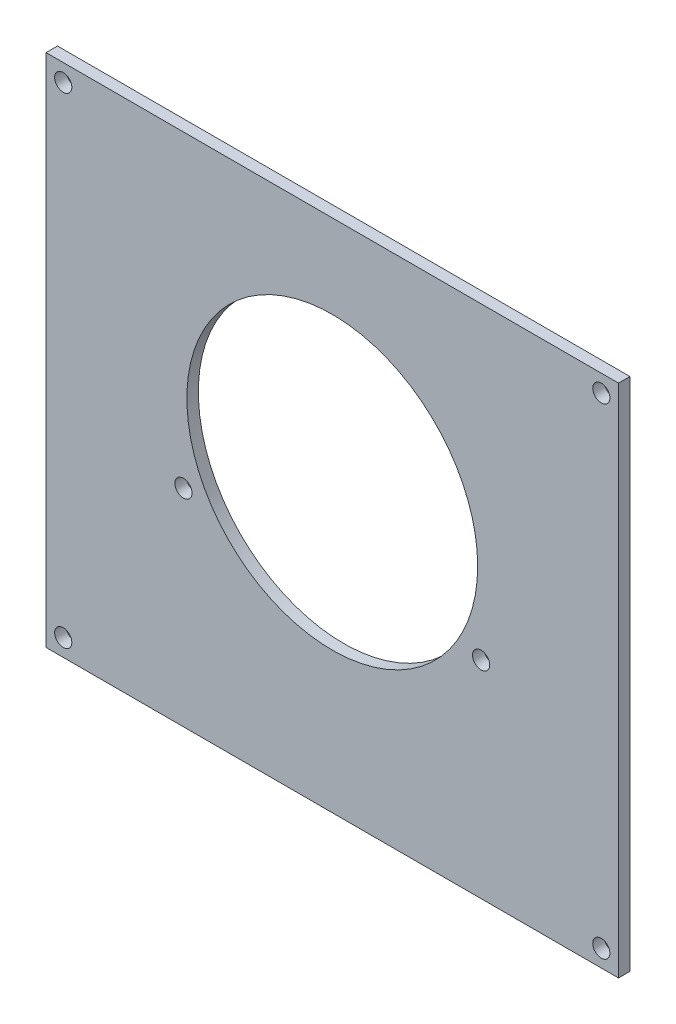
ISO-10303-21;
HEADER;
FILE_DESCRIPTION(('STEP AP214'),'2;1');
FILE_NAME('part.step','',(''),(''),'','','');
FILE_SCHEMA(('AUTOMOTIVE_DESIGN { 1 0 10303 214 1 1 1 1 }'));
ENDSEC;
DATA;
#1=APPLICATION_CONTEXT('core data for automotive mechanical design processes');
#2=APPLICATION_PROTOCOL_DEFINITION('international standard','automotive_design',2000,#1);
#3=PRODUCT_CONTEXT('',#1,'mechanical');
#4=PRODUCT('Part','Part','',(#3));
#5=PRODUCT_RELATED_PRODUCT_CATEGORY('part','',(#4));
#6=PRODUCT_DEFINITION_FORMATION('','',#4);
#7=PRODUCT_DEFINITION_CONTEXT('part definition',#1,'design');
#8=PRODUCT_DEFINITION('design','',#6,#7);
#9=PRODUCT_DEFINITION_SHAPE('','',#8);
#10=(LENGTH_UNIT() NAMED_UNIT(*) SI_UNIT(.MILLI.,.METRE.));
#11=(NAMED_UNIT(*) PLANE_ANGLE_UNIT() SI_UNIT($,.RADIAN.));
#12=(NAMED_UNIT(*) SI_UNIT($,.STERADIAN.) SOLID_ANGLE_UNIT());
#13=UNCERTAINTY_MEASURE_WITH_UNIT(LENGTH_MEASURE(1.E-05),#10,'distance_accuracy_value','');
#14=(GEOMETRIC_REPRESENTATION_CONTEXT(3) GLOBAL_UNCERTAINTY_ASSIGNED_CONTEXT((#13)) GLOBAL_UNIT_ASSIGNED_CONTEXT((#10,
#11,#12)) REPRESENTATION_CONTEXT('',''));
#15=CARTESIAN_POINT('',(0.,0.,0.));
#16=DIRECTION('',(0.,0.,1.));
#17=DIRECTION('',(1.,0.,0.));
#18=AXIS2_PLACEMENT_3D('',#15,#16,#17);
#19=CARTESIAN_POINT('',(0.,0.,0.));
#20=DIRECTION('',(0.,0.,1.));
#21=DIRECTION('',(1.,0.,0.));
#22=AXIS2_PLACEMENT_3D('',#19,#20,#21);
#23=PLANE('',#22);
#24=CARTESIAN_POINT('',(-73.2247091506369,-0.68557907607758,0.));
#25=DIRECTION('',(0.,0.,-1.));
#26=DIRECTION('',(-1.,0.,0.));
#27=AXIS2_PLACEMENT_3D('',#24,#25,#26);
#28=CIRCLE('',#27,1.51130000000001);
#29=CARTESIAN_POINT('',(-74.7360091506369,-0.68557907607758,0.));
#30=VERTEX_POINT('',#29);
#31=EDGE_CURVE('E349',#30,#30,#28,.T.);
#32=ORIENTED_EDGE('',*,*,#31,.F.);
#33=EDGE_LOOP('',(#32));
#34=FACE_BOUND('',#33,.T.);
#35=CARTESIAN_POINT('',(20.7752908493632,-0.685579076077578,0.));
#36=DIRECTION('',(0.,0.,-1.));
#37=DIRECTION('',(-1.,0.,0.));
#38=AXIS2_PLACEMENT_3D('',#35,#36,#37);
#39=CIRCLE('',#38,1.5113);
#40=CARTESIAN_POINT('',(19.2639908493632,-0.685579076077578,0.));
#41=VERTEX_POINT('',#40);
#42=EDGE_CURVE('E355',#41,#41,#39,.T.);
#43=ORIENTED_EDGE('',*,*,#42,.F.);
#44=EDGE_LOOP('',(#43));
#45=FACE_BOUND('',#44,.T.);
#46=CARTESIAN_POINT('',(-52.2247091506368,32.4144209239224,0.));
#47=DIRECTION('',(0.,0.,1.));
#48=DIRECTION('',(1.,0.,0.));
#49=AXIS2_PLACEMENT_3D('',#46,#47,#48);
#50=CIRCLE('',#49,1.5);
#51=CARTESIAN_POINT('',(-50.7247091506368,32.4144209239224,0.));
#52=VERTEX_POINT('',#51);
#53=EDGE_CURVE('E41',#52,#52,#50,.T.);
#54=ORIENTED_EDGE('',*,*,#53,.T.);
#55=EDGE_LOOP('',(#54));
#56=FACE_BOUND('',#55,.T.);
#57=CARTESIAN_POINT('',(-0.224709150636847,32.4144209239224,0.));
#58=DIRECTION('',(0.,0.,1.));
#59=DIRECTION('',(1.,0.,0.));
#60=AXIS2_PLACEMENT_3D('',#57,#58,#59);
#61=CIRCLE('',#60,1.5);
#62=CARTESIAN_POINT('',(1.27529084936315,32.4144209239224,0.));
#63=VERTEX_POINT('',#62);
#64=EDGE_CURVE('E115',#63,#63,#61,.T.);
#65=ORIENTED_EDGE('',*,*,#64,.T.);
#66=EDGE_LOOP('',(#65));
#67=FACE_BOUND('',#66,.T.);
#68=CARTESIAN_POINT('',(-26.2247091506368,46.3144209239224,0.));
#69=DIRECTION('',(0.,0.,1.));
#70=DIRECTION('',(1.,0.,0.));
#71=AXIS2_PLACEMENT_3D('',#68,#69,#70);
#72=CIRCLE('',#71,25.4);
#73=CARTESIAN_POINT('',(-0.82470915063684,46.3144209239224,0.));
#74=VERTEX_POINT('',#73);
#75=EDGE_CURVE('E107',#74,#74,#72,.T.);
#76=ORIENTED_EDGE('',*,*,#75,.T.);
#77=EDGE_LOOP('',(#76));
#78=FACE_BOUND('',#77,.T.);
#79=DIRECTION('',(0.,-1.,0.));
#80=VECTOR('',#79,1.);
#81=CARTESIAN_POINT('',(-76.2247091506369,86.3144209239224,0.));
#82=LINE('',#81,#80);
#83=CARTESIAN_POINT('',(-76.2247091506369,86.3144209239224,0.));
#84=VERTEX_POINT('',#83);
#85=CARTESIAN_POINT('',(-76.2247091506368,-3.68557907607758,0.));
#86=VERTEX_POINT('',#85);
#87=EDGE_CURVE('E104',#84,#86,#82,.T.);
#88=ORIENTED_EDGE('',*,*,#87,.F.);
#89=DIRECTION('',(-1.,0.,0.));
#90=VECTOR('',#89,1.);
#91=CARTESIAN_POINT('',(-76.2247091506369,86.3144209239224,0.));
#92=LINE('',#91,#90);
#93=CARTESIAN_POINT('',(23.7752908493632,86.3144209239224,0.));
#94=VERTEX_POINT('',#93);
#95=EDGE_CURVE('E79',#94,#84,#92,.T.);
#96=ORIENTED_EDGE('',*,*,#95,.F.);
#97=DIRECTION('',(0.,1.,0.));
#98=VECTOR('',#97,1.);
#99=CARTESIAN_POINT('',(23.7752908493632,86.3144209239224,0.));
#100=LINE('',#99,#98);
#101=CARTESIAN_POINT('',(23.7752908493632,-3.68557907607758,0.));
#102=VERTEX_POINT('',#101);
#103=EDGE_CURVE('E73',#102,#94,#100,.T.);
#104=ORIENTED_EDGE('',*,*,#103,.F.);
#105=DIRECTION('',(1.,0.,0.));
#106=VECTOR('',#105,1.);
#107=CARTESIAN_POINT('',(-76.2247091506368,-3.68557907607758,0.));
#108=LINE('',#107,#106);
#109=EDGE_CURVE('E95',#86,#102,#108,.T.);
#110=ORIENTED_EDGE('',*,*,#109,.F.);
#111=EDGE_LOOP('',(#88,#96,#104,#110));
#112=FACE_BOUND('',#111,.T.);
#113=CARTESIAN_POINT('',(-73.2247091506369,83.3144209239224,0.));
#114=DIRECTION('',(0.,0.,-1.));
#115=DIRECTION('',(-1.,0.,0.));
#116=AXIS2_PLACEMENT_3D('',#113,#114,#115);
#117=CIRCLE('',#116,1.51130000000001);
#118=CARTESIAN_POINT('',(-74.7360091506369,83.3144209239224,0.));
#119=VERTEX_POINT('',#118);
#120=EDGE_CURVE('E340',#119,#119,#117,.T.);
#121=ORIENTED_EDGE('',*,*,#120,.F.);
#122=EDGE_LOOP('',(#121));
#123=FACE_BOUND('',#122,.T.);
#124=CARTESIAN_POINT('',(20.7752908493632,83.3144209239224,0.));
#125=DIRECTION('',(0.,0.,-1.));
#126=DIRECTION('',(-1.,0.,0.));
#127=AXIS2_PLACEMENT_3D('',#124,#125,#126);
#128=CIRCLE('',#127,1.5113);
#129=CARTESIAN_POINT('',(19.2639908493632,83.3144209239224,0.));
#130=VERTEX_POINT('',#129);
#131=EDGE_CURVE('E336',#130,#130,#128,.T.);
#132=ORIENTED_EDGE('',*,*,#131,.F.);
#133=EDGE_LOOP('',(#132));
#134=FACE_BOUND('',#133,.T.);
#135=ADVANCED_FACE('F37',(#34,#45,#56,#67,#78,#112,#123,#134),#23,.F.);
#136=CARTESIAN_POINT('',(-76.2247091506369,86.3144209239224,2.));
#137=DIRECTION('',(1.,0.,0.));
#138=DIRECTION('',(0.,1.,0.));
#139=AXIS2_PLACEMENT_3D('',#136,#137,#138);
#140=PLANE('',#139);
#141=ORIENTED_EDGE('',*,*,#87,.T.);
#142=DIRECTION('',(0.,0.,-1.));
#143=VECTOR('',#142,1.);
#144=CARTESIAN_POINT('',(-76.2247091506368,-3.68557907607758,2.));
#145=LINE('',#144,#143);
#146=CARTESIAN_POINT('',(-76.2247091506368,-3.68557907607758,2.));
#147=VERTEX_POINT('',#146);
#148=EDGE_CURVE('E11',#147,#86,#145,.T.);
#149=ORIENTED_EDGE('',*,*,#148,.F.);
#150=DIRECTION('',(0.,-1.,0.));
#151=VECTOR('',#150,1.);
#152=CARTESIAN_POINT('',(-76.2247091506369,86.3144209239224,2.));
#153=LINE('',#152,#151);
#154=CARTESIAN_POINT('',(-76.2247091506369,86.3144209239224,2.));
#155=VERTEX_POINT('',#154);
#156=EDGE_CURVE('E91',#155,#147,#153,.T.);
#157=ORIENTED_EDGE('',*,*,#156,.F.);
#158=DIRECTION('',(0.,0.,-1.));
#159=VECTOR('',#158,1.);
#160=CARTESIAN_POINT('',(-76.2247091506369,86.3144209239224,2.));
#161=LINE('',#160,#159);
#162=EDGE_CURVE('E100',#155,#84,#161,.T.);
#163=ORIENTED_EDGE('',*,*,#162,.T.);
#164=EDGE_LOOP('',(#141,#149,#157,#163));
#165=FACE_BOUND('',#164,.T.);
#166=ADVANCED_FACE('F39',(#165),#140,.F.);
#167=CARTESIAN_POINT('',(-76.2247091506368,-3.68557907607758,2.));
#168=DIRECTION('',(0.,1.,0.));
#169=DIRECTION('',(0.,0.,1.));
#170=AXIS2_PLACEMENT_3D('',#167,#168,#169);
#171=PLANE('',#170);
#172=ORIENTED_EDGE('',*,*,#109,.T.);
#173=DIRECTION('',(0.,0.,-1.));
#174=VECTOR('',#173,1.);
#175=CARTESIAN_POINT('',(23.7752908493632,-3.68557907607758,2.));
#176=LINE('',#175,#174);
#177=CARTESIAN_POINT('',(23.7752908493632,-3.68557907607758,2.));
#178=VERTEX_POINT('',#177);
#179=EDGE_CURVE('E47',#178,#102,#176,.T.);
#180=ORIENTED_EDGE('',*,*,#179,.F.);
#181=DIRECTION('',(1.,0.,0.));
#182=VECTOR('',#181,1.);
#183=CARTESIAN_POINT('',(-76.2247091506368,-3.68557907607758,2.));
#184=LINE('',#183,#182);
#185=EDGE_CURVE('E86',#147,#178,#184,.T.);
#186=ORIENTED_EDGE('',*,*,#185,.F.);
#187=ORIENTED_EDGE('',*,*,#148,.T.);
#188=EDGE_LOOP('',(#172,#180,#186,#187));
#189=FACE_BOUND('',#188,.T.);
#190=ADVANCED_FACE('F94',(#189),#171,.F.);
#191=CARTESIAN_POINT('',(23.7752908493632,86.3144209239224,2.));
#192=DIRECTION('',(-1.,0.,0.));
#193=DIRECTION('',(0.,-1.,0.));
#194=AXIS2_PLACEMENT_3D('',#191,#192,#193);
#195=PLANE('',#194);
#196=ORIENTED_EDGE('',*,*,#103,.T.);
#197=DIRECTION('',(0.,0.,-1.));
#198=VECTOR('',#197,1.);
#199=CARTESIAN_POINT('',(23.7752908493632,86.3144209239224,2.));
#200=LINE('',#199,#198);
#201=CARTESIAN_POINT('',(23.7752908493632,86.3144209239224,2.));
#202=VERTEX_POINT('',#201);
#203=EDGE_CURVE('E96',#202,#94,#200,.T.);
#204=ORIENTED_EDGE('',*,*,#203,.F.);
#205=DIRECTION('',(0.,1.,0.));
#206=VECTOR('',#205,1.);
#207=CARTESIAN_POINT('',(23.7752908493632,86.3144209239224,2.));
#208=LINE('',#207,#206);
#209=EDGE_CURVE('E89',#178,#202,#208,.T.);
#210=ORIENTED_EDGE('',*,*,#209,.F.);
#211=ORIENTED_EDGE('',*,*,#179,.T.);
#212=EDGE_LOOP('',(#196,#204,#210,#211));
#213=FACE_BOUND('',#212,.T.);
#214=ADVANCED_FACE('F98',(#213),#195,.F.);
#215=CARTESIAN_POINT('',(-76.2247091506369,86.3144209239224,2.));
#216=DIRECTION('',(0.,-1.,0.));
#217=DIRECTION('',(0.,0.,-1.));
#218=AXIS2_PLACEMENT_3D('',#215,#216,#217);
#219=PLANE('',#218);
#220=ORIENTED_EDGE('',*,*,#95,.T.);
#221=ORIENTED_EDGE('',*,*,#162,.F.);
#222=DIRECTION('',(-1.,0.,0.));
#223=VECTOR('',#222,1.);
#224=CARTESIAN_POINT('',(-76.2247091506369,86.3144209239224,2.));
#225=LINE('',#224,#223);
#226=EDGE_CURVE('E56',#202,#155,#225,.T.);
#227=ORIENTED_EDGE('',*,*,#226,.F.);
#228=ORIENTED_EDGE('',*,*,#203,.T.);
#229=EDGE_LOOP('',(#220,#221,#227,#228));
#230=FACE_BOUND('',#229,.T.);
#231=ADVANCED_FACE('F139',(#230),#219,.F.);
#232=CARTESIAN_POINT('',(0.,0.,2.));
#233=DIRECTION('',(0.,0.,1.));
#234=DIRECTION('',(1.,0.,0.));
#235=AXIS2_PLACEMENT_3D('',#232,#233,#234);
#236=PLANE('',#235);
#237=CARTESIAN_POINT('',(20.7752908493632,-0.685579076077578,2.));
#238=DIRECTION('',(0.,0.,1.));
#239=DIRECTION('',(1.,0.,0.));
#240=AXIS2_PLACEMENT_3D('',#237,#238,#239);
#241=CIRCLE('',#240,1.5);
#242=CARTESIAN_POINT('',(22.2752908493632,-0.685579076077578,2.));
#243=VERTEX_POINT('',#242);
#244=EDGE_CURVE('E127',#243,#243,#241,.T.);
#245=ORIENTED_EDGE('',*,*,#244,.F.);
#246=EDGE_LOOP('',(#245));
#247=FACE_BOUND('',#246,.T.);
#248=CARTESIAN_POINT('',(-73.2247091506369,-0.68557907607758,2.));
#249=DIRECTION('',(0.,0.,1.));
#250=DIRECTION('',(1.,0.,0.));
#251=AXIS2_PLACEMENT_3D('',#248,#249,#250);
#252=CIRCLE('',#251,1.5);
#253=CARTESIAN_POINT('',(-71.7247091506369,-0.68557907607758,2.));
#254=VERTEX_POINT('',#253);
#255=EDGE_CURVE('E366',#254,#254,#252,.T.);
#256=ORIENTED_EDGE('',*,*,#255,.F.);
#257=EDGE_LOOP('',(#256));
#258=FACE_BOUND('',#257,.T.);
#259=CARTESIAN_POINT('',(-73.2247091506369,83.3144209239224,2.));
#260=DIRECTION('',(0.,0.,1.));
#261=DIRECTION('',(1.,0.,0.));
#262=AXIS2_PLACEMENT_3D('',#259,#260,#261);
#263=CIRCLE('',#262,1.5);
#264=CARTESIAN_POINT('',(-71.7247091506369,83.3144209239224,2.));
#265=VERTEX_POINT('',#264);
#266=EDGE_CURVE('E364',#265,#265,#263,.T.);
#267=ORIENTED_EDGE('',*,*,#266,.F.);
#268=EDGE_LOOP('',(#267));
#269=FACE_BOUND('',#268,.T.);
#270=CARTESIAN_POINT('',(20.7752908493632,83.3144209239224,2.));
#271=DIRECTION('',(0.,0.,1.));
#272=DIRECTION('',(1.,0.,0.));
#273=AXIS2_PLACEMENT_3D('',#270,#271,#272);
#274=CIRCLE('',#273,1.5);
#275=CARTESIAN_POINT('',(22.2752908493632,83.3144209239224,2.));
#276=VERTEX_POINT('',#275);
#277=EDGE_CURVE('E361',#276,#276,#274,.T.);
#278=ORIENTED_EDGE('',*,*,#277,.F.);
#279=EDGE_LOOP('',(#278));
#280=FACE_BOUND('',#279,.T.);
#281=CARTESIAN_POINT('',(-52.2247091506368,32.4144209239224,2.));
#282=DIRECTION('',(0.,0.,1.));
#283=DIRECTION('',(1.,0.,0.));
#284=AXIS2_PLACEMENT_3D('',#281,#282,#283);
#285=CIRCLE('',#284,1.5);
#286=CARTESIAN_POINT('',(-50.7247091506368,32.4144209239224,2.));
#287=VERTEX_POINT('',#286);
#288=EDGE_CURVE('E117',#287,#287,#285,.T.);
#289=ORIENTED_EDGE('',*,*,#288,.F.);
#290=EDGE_LOOP('',(#289));
#291=FACE_BOUND('',#290,.T.);
#292=CARTESIAN_POINT('',(-0.224709150636847,32.4144209239224,2.));
#293=DIRECTION('',(0.,0.,1.));
#294=DIRECTION('',(1.,0.,0.));
#295=AXIS2_PLACEMENT_3D('',#292,#293,#294);
#296=CIRCLE('',#295,1.5);
#297=CARTESIAN_POINT('',(1.27529084936315,32.4144209239224,2.));
#298=VERTEX_POINT('',#297);
#299=EDGE_CURVE('E122',#298,#298,#296,.T.);
#300=ORIENTED_EDGE('',*,*,#299,.F.);
#301=EDGE_LOOP('',(#300));
#302=FACE_BOUND('',#301,.T.);
#303=CARTESIAN_POINT('',(-26.2247091506368,46.3144209239224,2.));
#304=DIRECTION('',(0.,0.,1.));
#305=DIRECTION('',(1.,0.,0.));
#306=AXIS2_PLACEMENT_3D('',#303,#304,#305);
#307=CIRCLE('',#306,25.4);
#308=CARTESIAN_POINT('',(-0.82470915063684,46.3144209239224,2.));
#309=VERTEX_POINT('',#308);
#310=EDGE_CURVE('E114',#309,#309,#307,.T.);
#311=ORIENTED_EDGE('',*,*,#310,.F.);
#312=EDGE_LOOP('',(#311));
#313=FACE_BOUND('',#312,.T.);
#314=ORIENTED_EDGE('',*,*,#156,.T.);
#315=ORIENTED_EDGE('',*,*,#185,.T.);
#316=ORIENTED_EDGE('',*,*,#209,.T.);
#317=ORIENTED_EDGE('',*,*,#226,.T.);
#318=EDGE_LOOP('',(#314,#315,#316,#317));
#319=FACE_BOUND('',#318,.T.);
#320=ADVANCED_FACE('F87',(#247,#258,#269,#280,#291,#302,#313,#319),#236,.T.);
#321=CARTESIAN_POINT('',(-26.2247091506368,46.3144209239224,-1.));
#322=DIRECTION('',(0.,0.,1.));
#323=DIRECTION('',(1.,0.,0.));
#324=AXIS2_PLACEMENT_3D('',#321,#322,#323);
#325=CYLINDRICAL_SURFACE('',#324,25.4);
#326=ORIENTED_EDGE('',*,*,#310,.T.);
#327=EDGE_LOOP('',(#326));
#328=FACE_BOUND('',#327,.T.);
#329=ORIENTED_EDGE('',*,*,#75,.F.);
#330=EDGE_LOOP('',(#329));
#331=FACE_BOUND('',#330,.T.);
#332=ADVANCED_FACE('F135',(#328,#331),#325,.F.);
#333=CARTESIAN_POINT('',(-0.224709150636847,32.4144209239224,-1.));
#334=DIRECTION('',(0.,0.,1.));
#335=DIRECTION('',(1.,0.,0.));
#336=AXIS2_PLACEMENT_3D('',#333,#334,#335);
#337=CYLINDRICAL_SURFACE('',#336,1.5);
#338=ORIENTED_EDGE('',*,*,#299,.T.);
#339=EDGE_LOOP('',(#338));
#340=FACE_BOUND('',#339,.T.);
#341=ORIENTED_EDGE('',*,*,#64,.F.);
#342=EDGE_LOOP('',(#341));
#343=FACE_BOUND('',#342,.T.);
#344=ADVANCED_FACE('F146',(#340,#343),#337,.F.);
#345=CARTESIAN_POINT('',(-52.2247091506368,32.4144209239224,-1.));
#346=DIRECTION('',(0.,0.,1.));
#347=DIRECTION('',(1.,0.,0.));
#348=AXIS2_PLACEMENT_3D('',#345,#346,#347);
#349=CYLINDRICAL_SURFACE('',#348,1.5);
#350=ORIENTED_EDGE('',*,*,#288,.T.);
#351=EDGE_LOOP('',(#350));
#352=FACE_BOUND('',#351,.T.);
#353=ORIENTED_EDGE('',*,*,#53,.F.);
#354=EDGE_LOOP('',(#353));
#355=FACE_BOUND('',#354,.T.);
#356=ADVANCED_FACE('F193',(#352,#355),#349,.F.);
#357=CARTESIAN_POINT('',(20.7752908493632,83.3144209239224,10.));
#358=DIRECTION('',(0.,0.,-1.));
#359=DIRECTION('',(-1.,0.,0.));
#360=AXIS2_PLACEMENT_3D('',#357,#358,#359);
#361=CYLINDRICAL_SURFACE('',#360,1.5);
#362=CARTESIAN_POINT('',(20.7752908493632,83.3144209239224,0.00948182583230094));
#363=DIRECTION('',(0.,0.,-1.));
#364=DIRECTION('',(-1.,0.,0.));
#365=AXIS2_PLACEMENT_3D('',#362,#363,#364);
#366=CIRCLE('',#365,1.5);
#367=CARTESIAN_POINT('',(19.2752908493632,83.3144209239224,0.00948182583230094));
#368=VERTEX_POINT('',#367);
#369=EDGE_CURVE('E339',#368,#368,#366,.T.);
#370=ORIENTED_EDGE('',*,*,#369,.T.);
#371=EDGE_LOOP('',(#370));
#372=FACE_BOUND('',#371,.T.);
#373=ORIENTED_EDGE('',*,*,#277,.T.);
#374=EDGE_LOOP('',(#373));
#375=FACE_BOUND('',#374,.T.);
#376=ADVANCED_FACE('F203',(#372,#375),#361,.F.);
#377=CARTESIAN_POINT('',(-73.2247091506369,83.3144209239224,10.));
#378=DIRECTION('',(0.,0.,-1.));
#379=DIRECTION('',(-1.,0.,0.));
#380=AXIS2_PLACEMENT_3D('',#377,#378,#379);
#381=CYLINDRICAL_SURFACE('',#380,1.5);
#382=CARTESIAN_POINT('',(-73.2247091506369,83.3144209239224,0.00948182583230957));
#383=DIRECTION('',(0.,0.,-1.));
#384=DIRECTION('',(-1.,0.,0.));
#385=AXIS2_PLACEMENT_3D('',#382,#383,#384);
#386=CIRCLE('',#385,1.5);
#387=CARTESIAN_POINT('',(-74.7247091506369,83.3144209239224,0.00948182583230957));
#388=VERTEX_POINT('',#387);
#389=EDGE_CURVE('E343',#388,#388,#386,.T.);
#390=ORIENTED_EDGE('',*,*,#389,.T.);
#391=EDGE_LOOP('',(#390));
#392=FACE_BOUND('',#391,.T.);
#393=ORIENTED_EDGE('',*,*,#266,.T.);
#394=EDGE_LOOP('',(#393));
#395=FACE_BOUND('',#394,.T.);
#396=ADVANCED_FACE('F225',(#392,#395),#381,.F.);
#397=CARTESIAN_POINT('',(-73.2247091506369,-0.68557907607758,10.));
#398=DIRECTION('',(0.,0.,-1.));
#399=DIRECTION('',(-1.,0.,0.));
#400=AXIS2_PLACEMENT_3D('',#397,#398,#399);
#401=CYLINDRICAL_SURFACE('',#400,1.5);
#402=CARTESIAN_POINT('',(-73.2247091506369,-0.68557907607758,0.00948182583230957));
#403=DIRECTION('',(0.,0.,-1.));
#404=DIRECTION('',(-1.,0.,0.));
#405=AXIS2_PLACEMENT_3D('',#402,#403,#404);
#406=CIRCLE('',#405,1.5);
#407=CARTESIAN_POINT('',(-74.7247091506369,-0.68557907607758,0.00948182583230957));
#408=VERTEX_POINT('',#407);
#409=EDGE_CURVE('E352',#408,#408,#406,.T.);
#410=ORIENTED_EDGE('',*,*,#409,.T.);
#411=EDGE_LOOP('',(#410));
#412=FACE_BOUND('',#411,.T.);
#413=ORIENTED_EDGE('',*,*,#255,.T.);
#414=EDGE_LOOP('',(#413));
#415=FACE_BOUND('',#414,.T.);
#416=ADVANCED_FACE('F236',(#412,#415),#401,.F.);
#417=CARTESIAN_POINT('',(20.7752908493632,-0.685579076077578,10.));
#418=DIRECTION('',(0.,0.,-1.));
#419=DIRECTION('',(-1.,0.,0.));
#420=AXIS2_PLACEMENT_3D('',#417,#418,#419);
#421=CYLINDRICAL_SURFACE('',#420,1.5);
#422=CARTESIAN_POINT('',(20.7752908493632,-0.685579076077578,0.00948182583230112));
#423=DIRECTION('',(0.,0.,-1.));
#424=DIRECTION('',(-1.,0.,0.));
#425=AXIS2_PLACEMENT_3D('',#422,#423,#424);
#426=CIRCLE('',#425,1.5);
#427=CARTESIAN_POINT('',(19.2752908493632,-0.685579076077578,0.00948182583230112));
#428=VERTEX_POINT('',#427);
#429=EDGE_CURVE('E358',#428,#428,#426,.T.);
#430=ORIENTED_EDGE('',*,*,#429,.T.);
#431=EDGE_LOOP('',(#430));
#432=FACE_BOUND('',#431,.T.);
#433=ORIENTED_EDGE('',*,*,#244,.T.);
#434=EDGE_LOOP('',(#433));
#435=FACE_BOUND('',#434,.T.);
#436=ADVANCED_FACE('F247',(#432,#435),#421,.F.);
#437=CARTESIAN_POINT('',(20.7752908493632,-0.685579076077578,0.));
#438=DIRECTION('',(0.,0.,-1.));
#439=DIRECTION('',(-1.,0.,0.));
#440=AXIS2_PLACEMENT_3D('',#437,#438,#439);
#441=CONICAL_SURFACE('',#440,1.5113,0.872664625997163);
#442=ORIENTED_EDGE('',*,*,#42,.T.);
#443=EDGE_LOOP('',(#442));
#444=FACE_BOUND('',#443,.T.);
#445=ORIENTED_EDGE('',*,*,#429,.F.);
#446=EDGE_LOOP('',(#445));
#447=FACE_BOUND('',#446,.T.);
#448=ADVANCED_FACE('F257',(#444,#447),#441,.F.);
#449=CARTESIAN_POINT('',(-73.2247091506369,-0.68557907607758,0.));
#450=DIRECTION('',(0.,0.,-1.));
#451=DIRECTION('',(-1.,0.,0.));
#452=AXIS2_PLACEMENT_3D('',#449,#450,#451);
#453=CONICAL_SURFACE('',#452,1.51130000000001,0.872664625997168);
#454=ORIENTED_EDGE('',*,*,#31,.T.);
#455=EDGE_LOOP('',(#454));
#456=FACE_BOUND('',#455,.T.);
#457=ORIENTED_EDGE('',*,*,#409,.F.);
#458=EDGE_LOOP('',(#457));
#459=FACE_BOUND('',#458,.T.);
#460=ADVANCED_FACE('F267',(#456,#459),#453,.F.);
#461=CARTESIAN_POINT('',(-73.2247091506369,83.3144209239224,0.));
#462=DIRECTION('',(0.,0.,-1.));
#463=DIRECTION('',(-1.,0.,0.));
#464=AXIS2_PLACEMENT_3D('',#461,#462,#463);
#465=CONICAL_SURFACE('',#464,1.51130000000001,0.872664625997168);
#466=ORIENTED_EDGE('',*,*,#120,.T.);
#467=EDGE_LOOP('',(#466));
#468=FACE_BOUND('',#467,.T.);
#469=ORIENTED_EDGE('',*,*,#389,.F.);
#470=EDGE_LOOP('',(#469));
#471=FACE_BOUND('',#470,.T.);
#472=ADVANCED_FACE('F278',(#468,#471),#465,.F.);
#473=CARTESIAN_POINT('',(20.7752908493632,83.3144209239224,0.));
#474=DIRECTION('',(0.,0.,-1.));
#475=DIRECTION('',(-1.,0.,0.));
#476=AXIS2_PLACEMENT_3D('',#473,#474,#475);
#477=CONICAL_SURFACE('',#476,1.5113,0.872664625997163);
#478=ORIENTED_EDGE('',*,*,#131,.T.);
#479=EDGE_LOOP('',(#478));
#480=FACE_BOUND('',#479,.T.);
#481=ORIENTED_EDGE('',*,*,#369,.F.);
#482=EDGE_LOOP('',(#481));
#483=FACE_BOUND('',#482,.T.);
#484=ADVANCED_FACE('F289',(#480,#483),#477,.F.);
#485=CLOSED_SHELL('',(#135,#166,#190,#214,#231,#320,#332,#344,#356,#376,#396,#416,#436,#448,
#460,#472,#484));
#486=MANIFOLD_SOLID_BREP('B2',#485);
#487=ADVANCED_BREP_SHAPE_REPRESENTATION('',(#18,#486),#14);
#488=SHAPE_DEFINITION_REPRESENTATION(#9,#487);
ENDSEC;
END-ISO-10303-21;
